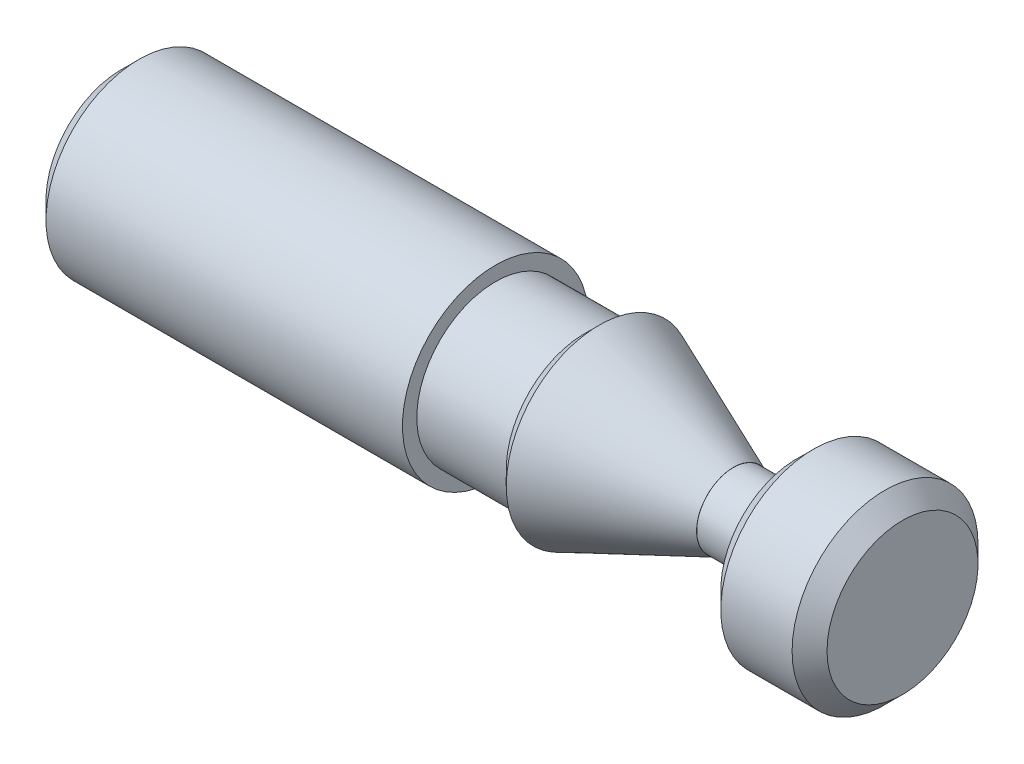
ISO-10303-21;
HEADER;
FILE_DESCRIPTION(('STEP AP214'),'2;1');
FILE_NAME('part.step','',(''),(''),'','','');
FILE_SCHEMA(('AUTOMOTIVE_DESIGN { 1 0 10303 214 1 1 1 1 }'));
ENDSEC;
DATA;
#1=APPLICATION_CONTEXT('core data for automotive mechanical design processes');
#2=APPLICATION_PROTOCOL_DEFINITION('international standard','automotive_design',2000,#1);
#3=PRODUCT_CONTEXT('',#1,'mechanical');
#4=PRODUCT('Part','Part','',(#3));
#5=PRODUCT_RELATED_PRODUCT_CATEGORY('part','',(#4));
#6=PRODUCT_DEFINITION_FORMATION('','',#4);
#7=PRODUCT_DEFINITION_CONTEXT('part definition',#1,'design');
#8=PRODUCT_DEFINITION('design','',#6,#7);
#9=PRODUCT_DEFINITION_SHAPE('','',#8);
#10=(LENGTH_UNIT() NAMED_UNIT(*) SI_UNIT(.MILLI.,.METRE.));
#11=(NAMED_UNIT(*) PLANE_ANGLE_UNIT() SI_UNIT($,.RADIAN.));
#12=(NAMED_UNIT(*) SI_UNIT($,.STERADIAN.) SOLID_ANGLE_UNIT());
#13=UNCERTAINTY_MEASURE_WITH_UNIT(LENGTH_MEASURE(1.E-05),#10,'distance_accuracy_value','');
#14=(GEOMETRIC_REPRESENTATION_CONTEXT(3) GLOBAL_UNCERTAINTY_ASSIGNED_CONTEXT((#13)) GLOBAL_UNIT_ASSIGNED_CONTEXT((#10,
#11,#12)) REPRESENTATION_CONTEXT('',''));
#15=CARTESIAN_POINT('',(0.,0.,0.));
#16=DIRECTION('',(0.,0.,1.));
#17=DIRECTION('',(1.,0.,0.));
#18=AXIS2_PLACEMENT_3D('',#15,#16,#17);
#19=CARTESIAN_POINT('',(0.,-2.18592,2.18592));
#20=DIRECTION('',(1.,0.,0.));
#21=DIRECTION('',(0.,0.,-1.));
#22=AXIS2_PLACEMENT_3D('',#19,#20,#21);
#23=PLANE('',#22);
#24=CARTESIAN_POINT('',(0.,0.,0.));
#25=DIRECTION('',(-1.,0.,0.));
#26=DIRECTION('',(0.,0.,1.));
#27=AXIS2_PLACEMENT_3D('',#24,#25,#26);
#28=CIRCLE('',#27,2.16);
#29=CARTESIAN_POINT('',(0.,0.,2.16));
#30=VERTEX_POINT('',#29);
#31=EDGE_CURVE('E17',#30,#30,#28,.F.);
#32=ORIENTED_EDGE('',*,*,#31,.T.);
#33=EDGE_LOOP('',(#32));
#34=FACE_BOUND('',#33,.T.);
#35=ADVANCED_FACE('F13',(#34),#23,.T.);
#36=CARTESIAN_POINT('',(0.,0.,0.));
#37=DIRECTION('',(-1.,0.,0.));
#38=DIRECTION('',(0.,0.,1.));
#39=AXIS2_PLACEMENT_3D('',#36,#37,#38);
#40=CONICAL_SURFACE('',#39,2.16,0.785398163397448);
#41=ORIENTED_EDGE('',*,*,#31,.F.);
#42=EDGE_LOOP('',(#41));
#43=FACE_BOUND('',#42,.T.);
#44=CARTESIAN_POINT('',(-0.5,0.,0.));
#45=DIRECTION('',(1.,0.,0.));
#46=DIRECTION('',(0.,0.,-1.));
#47=AXIS2_PLACEMENT_3D('',#44,#45,#46);
#48=CIRCLE('',#47,2.66);
#49=CARTESIAN_POINT('',(-0.5,0.,-2.66));
#50=VERTEX_POINT('',#49);
#51=EDGE_CURVE('E38',#50,#50,#48,.T.);
#52=ORIENTED_EDGE('',*,*,#51,.T.);
#53=EDGE_LOOP('',(#52));
#54=FACE_BOUND('',#53,.T.);
#55=ADVANCED_FACE('F105',(#43,#54),#40,.T.);
#56=CARTESIAN_POINT('',(-2.54,0.,0.));
#57=DIRECTION('',(1.,0.,0.));
#58=DIRECTION('',(0.,0.,-1.));
#59=AXIS2_PLACEMENT_3D('',#56,#57,#58);
#60=CYLINDRICAL_SURFACE('',#59,2.66);
#61=CARTESIAN_POINT('',(-2.53999999999999,0.,0.));
#62=DIRECTION('',(1.,0.,0.));
#63=DIRECTION('',(0.,0.,-1.));
#64=AXIS2_PLACEMENT_3D('',#61,#62,#63);
#65=CIRCLE('',#64,2.66);
#66=CARTESIAN_POINT('',(-2.54,0.,-2.66));
#67=VERTEX_POINT('',#66);
#68=EDGE_CURVE('E34',#67,#67,#65,.T.);
#69=ORIENTED_EDGE('',*,*,#68,.T.);
#70=EDGE_LOOP('',(#69));
#71=FACE_BOUND('',#70,.T.);
#72=ORIENTED_EDGE('',*,*,#51,.F.);
#73=EDGE_LOOP('',(#72));
#74=FACE_BOUND('',#73,.T.);
#75=ADVANCED_FACE('F102',(#71,#74),#60,.T.);
#76=CARTESIAN_POINT('',(-3.04,0.,0.));
#77=DIRECTION('',(1.,0.,0.));
#78=DIRECTION('',(0.,0.,-1.));
#79=AXIS2_PLACEMENT_3D('',#76,#77,#78);
#80=CONICAL_SURFACE('',#79,2.16,0.785398163397448);
#81=CARTESIAN_POINT('',(-3.04000000000004,0.,0.));
#82=DIRECTION('',(1.,0.,0.));
#83=DIRECTION('',(0.,0.,-1.));
#84=AXIS2_PLACEMENT_3D('',#81,#82,#83);
#85=CIRCLE('',#84,2.15999999999996);
#86=CARTESIAN_POINT('',(-3.04000000000004,0.,-2.15999999999996));
#87=VERTEX_POINT('',#86);
#88=EDGE_CURVE('E37',#87,#87,#85,.T.);
#89=ORIENTED_EDGE('',*,*,#88,.T.);
#90=EDGE_LOOP('',(#89));
#91=FACE_BOUND('',#90,.T.);
#92=ORIENTED_EDGE('',*,*,#68,.F.);
#93=EDGE_LOOP('',(#92));
#94=FACE_BOUND('',#93,.T.);
#95=ADVANCED_FACE('F58',(#91,#94),#80,.T.);
#96=CARTESIAN_POINT('',(-22.35,-2.18592,2.18592));
#97=DIRECTION('',(1.,0.,0.));
#98=DIRECTION('',(0.,0.,-1.));
#99=AXIS2_PLACEMENT_3D('',#96,#97,#98);
#100=PLANE('',#99);
#101=CARTESIAN_POINT('',(-22.35,0.,0.));
#102=DIRECTION('',(1.,0.,0.));
#103=DIRECTION('',(0.,0.,-1.));
#104=AXIS2_PLACEMENT_3D('',#101,#102,#103);
#105=CIRCLE('',#104,2.16000000000002);
#106=CARTESIAN_POINT('',(-22.35,0.,-2.16000000000002));
#107=VERTEX_POINT('',#106);
#108=EDGE_CURVE('E53',#107,#107,#105,.F.);
#109=ORIENTED_EDGE('',*,*,#108,.T.);
#110=EDGE_LOOP('',(#109));
#111=FACE_BOUND('',#110,.T.);
#112=ADVANCED_FACE('F64',(#111),#100,.F.);
#113=CARTESIAN_POINT('',(-3.04,-2.18592,2.18592));
#114=DIRECTION('',(1.,0.,0.));
#115=DIRECTION('',(0.,0.,-1.));
#116=AXIS2_PLACEMENT_3D('',#113,#114,#115);
#117=PLANE('',#116);
#118=CARTESIAN_POINT('',(-3.04,0.,0.));
#119=DIRECTION('',(1.,0.,0.));
#120=DIRECTION('',(0.,0.,-1.));
#121=AXIS2_PLACEMENT_3D('',#118,#119,#120);
#122=CIRCLE('',#121,1.05);
#123=CARTESIAN_POINT('',(-3.04,0.,-1.05));
#124=VERTEX_POINT('',#123);
#125=EDGE_CURVE('E33',#124,#124,#122,.T.);
#126=ORIENTED_EDGE('',*,*,#125,.T.);
#127=EDGE_LOOP('',(#126));
#128=FACE_BOUND('',#127,.T.);
#129=ORIENTED_EDGE('',*,*,#88,.F.);
#130=EDGE_LOOP('',(#129));
#131=FACE_BOUND('',#130,.T.);
#132=ADVANCED_FACE('F61',(#128,#131),#117,.F.);
#133=CARTESIAN_POINT('',(-22.35,0.,0.));
#134=DIRECTION('',(1.,0.,0.));
#135=DIRECTION('',(0.,0.,-1.));
#136=AXIS2_PLACEMENT_3D('',#133,#134,#135);
#137=CONICAL_SURFACE('',#136,2.16,0.785398163397448);
#138=ORIENTED_EDGE('',*,*,#108,.F.);
#139=EDGE_LOOP('',(#138));
#140=FACE_BOUND('',#139,.T.);
#141=CARTESIAN_POINT('',(-21.85,0.,0.));
#142=DIRECTION('',(1.,0.,0.));
#143=DIRECTION('',(0.,0.,-1.));
#144=AXIS2_PLACEMENT_3D('',#141,#142,#143);
#145=CIRCLE('',#144,2.66);
#146=CARTESIAN_POINT('',(-21.85,0.,-2.66));
#147=VERTEX_POINT('',#146);
#148=EDGE_CURVE('E29',#147,#147,#145,.F.);
#149=ORIENTED_EDGE('',*,*,#148,.T.);
#150=EDGE_LOOP('',(#149));
#151=FACE_BOUND('',#150,.T.);
#152=ADVANCED_FACE('F63',(#140,#151),#137,.T.);
#153=CARTESIAN_POINT('',(-4.84,0.,0.));
#154=DIRECTION('',(1.,0.,0.));
#155=DIRECTION('',(0.,0.,-1.));
#156=AXIS2_PLACEMENT_3D('',#153,#154,#155);
#157=CYLINDRICAL_SURFACE('',#156,1.05);
#158=ORIENTED_EDGE('',*,*,#125,.F.);
#159=EDGE_LOOP('',(#158));
#160=FACE_BOUND('',#159,.T.);
#161=CARTESIAN_POINT('',(-4.84,0.,0.));
#162=DIRECTION('',(1.,0.,0.));
#163=DIRECTION('',(0.,0.,-1.));
#164=AXIS2_PLACEMENT_3D('',#161,#162,#163);
#165=CIRCLE('',#164,1.05);
#166=CARTESIAN_POINT('',(-4.84,0.,-1.05));
#167=VERTEX_POINT('',#166);
#168=EDGE_CURVE('E32',#167,#167,#165,.F.);
#169=ORIENTED_EDGE('',*,*,#168,.F.);
#170=EDGE_LOOP('',(#169));
#171=FACE_BOUND('',#170,.T.);
#172=ADVANCED_FACE('F72',(#160,#171),#157,.T.);
#173=CARTESIAN_POINT('',(-21.85,0.,0.));
#174=DIRECTION('',(1.,0.,0.));
#175=DIRECTION('',(0.,0.,-1.));
#176=AXIS2_PLACEMENT_3D('',#173,#174,#175);
#177=CYLINDRICAL_SURFACE('',#176,2.66);
#178=ORIENTED_EDGE('',*,*,#148,.F.);
#179=EDGE_LOOP('',(#178));
#180=FACE_BOUND('',#179,.T.);
#181=CARTESIAN_POINT('',(-11.65,0.,0.));
#182=DIRECTION('',(1.,0.,0.));
#183=DIRECTION('',(0.,0.,-1.));
#184=AXIS2_PLACEMENT_3D('',#181,#182,#183);
#185=CIRCLE('',#184,2.66);
#186=CARTESIAN_POINT('',(-11.65,0.,-2.66));
#187=VERTEX_POINT('',#186);
#188=EDGE_CURVE('E46',#187,#187,#185,.T.);
#189=ORIENTED_EDGE('',*,*,#188,.F.);
#190=EDGE_LOOP('',(#189));
#191=FACE_BOUND('',#190,.T.);
#192=ADVANCED_FACE('F92',(#180,#191),#177,.T.);
#193=CARTESIAN_POINT('',(-4.84,-1.066301496,1.066301496));
#194=DIRECTION('',(1.,0.,0.));
#195=DIRECTION('',(0.,0.,-1.));
#196=AXIS2_PLACEMENT_3D('',#193,#194,#195);
#197=PLANE('',#196);
#198=ORIENTED_EDGE('',*,*,#168,.T.);
#199=EDGE_LOOP('',(#198));
#200=FACE_BOUND('',#199,.T.);
#201=CARTESIAN_POINT('',(-4.83999999999996,0.,0.));
#202=DIRECTION('',(-1.,0.,0.));
#203=DIRECTION('',(0.,0.,1.));
#204=AXIS2_PLACEMENT_3D('',#201,#202,#203);
#205=CIRCLE('',#204,1.05365760499998);
#206=CARTESIAN_POINT('',(-4.83999999999996,0.,1.05365760499998));
#207=VERTEX_POINT('',#206);
#208=EDGE_CURVE('E43',#207,#207,#205,.F.);
#209=ORIENTED_EDGE('',*,*,#208,.T.);
#210=EDGE_LOOP('',(#209));
#211=FACE_BOUND('',#210,.T.);
#212=ADVANCED_FACE('F95',(#200,#211),#197,.T.);
#213=CARTESIAN_POINT('',(-11.65,-2.69192,2.69192));
#214=DIRECTION('',(1.,0.,0.));
#215=DIRECTION('',(0.,0.,-1.));
#216=AXIS2_PLACEMENT_3D('',#213,#214,#215);
#217=PLANE('',#216);
#218=CARTESIAN_POINT('',(-11.65,0.,0.));
#219=DIRECTION('',(1.,0.,0.));
#220=DIRECTION('',(0.,0.,-1.));
#221=AXIS2_PLACEMENT_3D('',#218,#219,#220);
#222=CIRCLE('',#221,2.25);
#223=CARTESIAN_POINT('',(-11.65,0.,-2.25));
#224=VERTEX_POINT('',#223);
#225=EDGE_CURVE('E26',#224,#224,#222,.F.);
#226=ORIENTED_EDGE('',*,*,#225,.T.);
#227=EDGE_LOOP('',(#226));
#228=FACE_BOUND('',#227,.T.);
#229=ORIENTED_EDGE('',*,*,#188,.T.);
#230=EDGE_LOOP('',(#229));
#231=FACE_BOUND('',#230,.T.);
#232=ADVANCED_FACE('F15',(#228,#231),#217,.T.);
#233=CARTESIAN_POINT('',(-4.84,0.,0.));
#234=DIRECTION('',(-1.,0.,0.));
#235=DIRECTION('',(0.,0.,1.));
#236=AXIS2_PLACEMENT_3D('',#233,#234,#235);
#237=CONICAL_SURFACE('',#236,1.053657605,0.396227073871453);
#238=CARTESIAN_POINT('',(-8.67968244400008,0.,0.));
#239=DIRECTION('',(1.,0.,0.));
#240=DIRECTION('',(0.,0.,-1.));
#241=AXIS2_PLACEMENT_3D('',#238,#239,#240);
#242=CIRCLE('',#241,2.66);
#243=CARTESIAN_POINT('',(-8.679682444,0.,-2.66));
#244=VERTEX_POINT('',#243);
#245=EDGE_CURVE('E21',#244,#244,#242,.T.);
#246=ORIENTED_EDGE('',*,*,#245,.T.);
#247=EDGE_LOOP('',(#246));
#248=FACE_BOUND('',#247,.T.);
#249=ORIENTED_EDGE('',*,*,#208,.F.);
#250=EDGE_LOOP('',(#249));
#251=FACE_BOUND('',#250,.T.);
#252=ADVANCED_FACE('F85',(#248,#251),#237,.T.);
#253=CARTESIAN_POINT('',(-11.65,0.,0.));
#254=DIRECTION('',(1.,0.,0.));
#255=DIRECTION('',(0.,0.,-1.));
#256=AXIS2_PLACEMENT_3D('',#253,#254,#255);
#257=CYLINDRICAL_SURFACE('',#256,2.25);
#258=CARTESIAN_POINT('',(-9.09000000000004,0.,0.));
#259=DIRECTION('',(1.,0.,0.));
#260=DIRECTION('',(0.,0.,-1.));
#261=AXIS2_PLACEMENT_3D('',#258,#259,#260);
#262=CIRCLE('',#261,2.25);
#263=CARTESIAN_POINT('',(-9.09,0.,-2.25));
#264=VERTEX_POINT('',#263);
#265=EDGE_CURVE('E8',#264,#264,#262,.F.);
#266=ORIENTED_EDGE('',*,*,#265,.T.);
#267=EDGE_LOOP('',(#266));
#268=FACE_BOUND('',#267,.T.);
#269=ORIENTED_EDGE('',*,*,#225,.F.);
#270=EDGE_LOOP('',(#269));
#271=FACE_BOUND('',#270,.T.);
#272=ADVANCED_FACE('F79',(#268,#271),#257,.T.);
#273=CARTESIAN_POINT('',(-9.09,0.,0.));
#274=DIRECTION('',(1.,0.,0.));
#275=DIRECTION('',(0.,0.,-1.));
#276=AXIS2_PLACEMENT_3D('',#273,#274,#275);
#277=CONICAL_SURFACE('',#276,2.25,0.785011049917047);
#278=ORIENTED_EDGE('',*,*,#265,.F.);
#279=EDGE_LOOP('',(#278));
#280=FACE_BOUND('',#279,.T.);
#281=ORIENTED_EDGE('',*,*,#245,.F.);
#282=EDGE_LOOP('',(#281));
#283=FACE_BOUND('',#282,.T.);
#284=ADVANCED_FACE('F77',(#280,#283),#277,.T.);
#285=CLOSED_SHELL('',(#35,#55,#75,#95,#112,#132,#152,#172,#192,#212,#232,#252,#272,#284));
#286=MANIFOLD_SOLID_BREP('B1',#285);
#287=ADVANCED_BREP_SHAPE_REPRESENTATION('',(#18,#286),#14);
#288=SHAPE_DEFINITION_REPRESENTATION(#9,#287);
ENDSEC;
END-ISO-10303-21;
